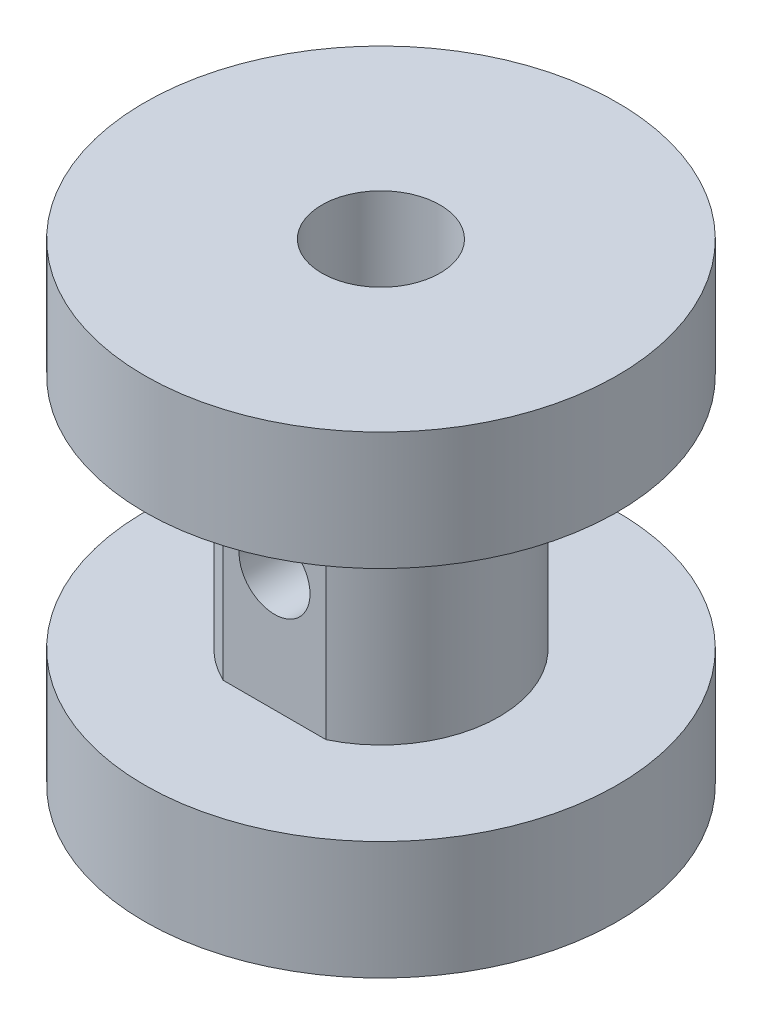
ISO-10303-21;
HEADER;
FILE_DESCRIPTION(('STEP AP214'),'2;1');
FILE_NAME('part.step','',(''),(''),'','','');
FILE_SCHEMA(('AUTOMOTIVE_DESIGN { 1 0 10303 214 1 1 1 1 }'));
ENDSEC;
DATA;
#1=APPLICATION_CONTEXT('core data for automotive mechanical design processes');
#2=APPLICATION_PROTOCOL_DEFINITION('international standard','automotive_design',2000,#1);
#3=PRODUCT_CONTEXT('',#1,'mechanical');
#4=PRODUCT('Part','Part','',(#3));
#5=PRODUCT_RELATED_PRODUCT_CATEGORY('part','',(#4));
#6=PRODUCT_DEFINITION_FORMATION('','',#4);
#7=PRODUCT_DEFINITION_CONTEXT('part definition',#1,'design');
#8=PRODUCT_DEFINITION('design','',#6,#7);
#9=PRODUCT_DEFINITION_SHAPE('','',#8);
#10=(LENGTH_UNIT() NAMED_UNIT(*) SI_UNIT(.MILLI.,.METRE.));
#11=(NAMED_UNIT(*) PLANE_ANGLE_UNIT() SI_UNIT($,.RADIAN.));
#12=(NAMED_UNIT(*) SI_UNIT($,.STERADIAN.) SOLID_ANGLE_UNIT());
#13=UNCERTAINTY_MEASURE_WITH_UNIT(LENGTH_MEASURE(1.E-05),#10,'distance_accuracy_value','');
#14=(GEOMETRIC_REPRESENTATION_CONTEXT(3) GLOBAL_UNCERTAINTY_ASSIGNED_CONTEXT((#13)) GLOBAL_UNIT_ASSIGNED_CONTEXT((#10,
#11,#12)) REPRESENTATION_CONTEXT('',''));
#15=CARTESIAN_POINT('',(0.,0.,0.));
#16=DIRECTION('',(0.,0.,1.));
#17=DIRECTION('',(1.,0.,0.));
#18=AXIS2_PLACEMENT_3D('',#15,#16,#17);
#19=CARTESIAN_POINT('',(0.,10.,0.));
#20=DIRECTION('',(0.,-1.,0.));
#21=DIRECTION('',(0.,0.,-1.));
#22=AXIS2_PLACEMENT_3D('',#19,#20,#21);
#23=CYLINDRICAL_SURFACE('',#22,10.);
#24=CARTESIAN_POINT('',(0.,-10.,0.));
#25=DIRECTION('',(0.,1.,0.));
#26=DIRECTION('',(0.,0.,1.));
#27=AXIS2_PLACEMENT_3D('',#24,#25,#26);
#28=CIRCLE('',#27,10.);
#29=CARTESIAN_POINT('',(0.,-10.,10.));
#30=VERTEX_POINT('',#29);
#31=EDGE_CURVE('E76',#30,#30,#28,.T.);
#32=ORIENTED_EDGE('',*,*,#31,.T.);
#33=EDGE_LOOP('',(#32));
#34=FACE_BOUND('',#33,.T.);
#35=CARTESIAN_POINT('',(0.,-5.,0.));
#36=DIRECTION('',(0.,1.,0.));
#37=DIRECTION('',(0.,0.,1.));
#38=AXIS2_PLACEMENT_3D('',#35,#36,#37);
#39=CIRCLE('',#38,10.);
#40=CARTESIAN_POINT('',(0.,-5.,10.));
#41=VERTEX_POINT('',#40);
#42=EDGE_CURVE('E86',#41,#41,#39,.T.);
#43=ORIENTED_EDGE('',*,*,#42,.F.);
#44=EDGE_LOOP('',(#43));
#45=FACE_BOUND('',#44,.T.);
#46=ADVANCED_FACE('F34',(#34,#45),#23,.T.);
#47=CARTESIAN_POINT('',(0.,5.,0.));
#48=DIRECTION('',(0.,1.,0.));
#49=DIRECTION('',(0.,0.,1.));
#50=AXIS2_PLACEMENT_3D('',#47,#48,#49);
#51=CIRCLE('',#50,10.);
#52=CARTESIAN_POINT('',(0.,5.,10.));
#53=VERTEX_POINT('',#52);
#54=EDGE_CURVE('E70',#53,#53,#51,.T.);
#55=ORIENTED_EDGE('',*,*,#54,.T.);
#56=EDGE_LOOP('',(#55));
#57=FACE_BOUND('',#56,.T.);
#58=CARTESIAN_POINT('',(0.,10.,0.));
#59=DIRECTION('',(0.,1.,0.));
#60=DIRECTION('',(0.,0.,1.));
#61=AXIS2_PLACEMENT_3D('',#58,#59,#60);
#62=CIRCLE('',#61,10.);
#63=CARTESIAN_POINT('',(0.,10.,10.));
#64=VERTEX_POINT('',#63);
#65=EDGE_CURVE('E44',#64,#64,#62,.T.);
#66=ORIENTED_EDGE('',*,*,#65,.F.);
#67=EDGE_LOOP('',(#66));
#68=FACE_BOUND('',#67,.T.);
#69=ADVANCED_FACE('F36',(#57,#68),#23,.T.);
#70=CARTESIAN_POINT('',(0.,10.,0.));
#71=DIRECTION('',(0.,-1.,0.));
#72=DIRECTION('',(0.,0.,-1.));
#73=AXIS2_PLACEMENT_3D('',#70,#71,#72);
#74=CYLINDRICAL_SURFACE('',#73,2.5);
#75=CARTESIAN_POINT('',(1.5,0.,2.));
#76=CARTESIAN_POINT('',(1.50000404108592,0.0754789752896368,1.99999416642511));
#77=CARTESIAN_POINT('',(1.49426852824013,0.150938434079796,2.00433633903481));
#78=CARTESIAN_POINT('',(1.47174965152787,0.299323903962216,2.02092590613883));
#79=CARTESIAN_POINT('',(1.45495475788936,0.372247187385098,2.03318155043097));
#80=CARTESIAN_POINT('',(1.41143486335795,0.513083641677277,2.0636233903473));
#81=CARTESIAN_POINT('',(1.3847815450315,0.581028838035267,2.0817666618312));
#82=CARTESIAN_POINT('',(1.32252909283019,0.711437453367919,2.12185904995836));
#83=CARTESIAN_POINT('',(1.28692729054693,0.773899229695138,2.14380930122416));
#84=CARTESIAN_POINT('',(1.20271292747644,0.899949016664082,2.19228594587542));
#85=CARTESIAN_POINT('',(1.15304179435289,0.962740957123942,2.21904371037662));
#86=CARTESIAN_POINT('',(1.04426801309985,1.07976476274175,2.27226229431061));
#87=CARTESIAN_POINT('',(0.985158296729613,1.1339901516708,2.29872287517103));
#88=CARTESIAN_POINT('',(0.851442367411702,1.2381338097097,2.35175567858734));
#89=CARTESIAN_POINT('',(0.775851995162548,1.28695446366975,2.37803133577818));
#90=CARTESIAN_POINT('',(0.615654228271659,1.37080972244443,2.42443786983179));
#91=CARTESIAN_POINT('',(0.531055196626331,1.40585697412271,2.44457437988735));
#92=CARTESIAN_POINT('',(0.363771406742667,1.45759592281265,2.4747098780044));
#93=CARTESIAN_POINT('',(0.281674698130916,1.4757203609673,2.4854930393917));
#94=CARTESIAN_POINT('',(0.114970509382709,1.49794280286312,2.49874939277545));
#95=CARTESIAN_POINT('',(0.0303654624001538,1.50205397800005,2.50123038813307));
#96=CARTESIAN_POINT('',(-0.127637283737309,1.49638625265754,2.49783372711539));
#97=CARTESIAN_POINT('',(-0.201123832865634,1.48826647383069,2.49295437513726));
#98=CARTESIAN_POINT('',(-0.345464269151768,1.46152020435189,2.47707997553857));
#99=CARTESIAN_POINT('',(-0.416317961051201,1.44289293609285,2.46608447529309));
#100=CARTESIAN_POINT('',(-0.55405678046908,1.39583443729622,2.43884907201719));
#101=CARTESIAN_POINT('',(-0.620916491037617,1.367346938861,2.42257910450824));
#102=CARTESIAN_POINT('',(-0.748988660115611,1.30161538377446,2.38609637638748));
#103=CARTESIAN_POINT('',(-0.810199646208011,1.26436905294099,2.36588259201812));
#104=CARTESIAN_POINT('',(-0.9330742671432,1.17716090719555,2.32037925976363));
#105=CARTESIAN_POINT('',(-0.993918663198193,1.12621168826426,2.2947718295215));
#106=CARTESIAN_POINT('',(-1.10671465909275,1.01559588213982,2.24255554245601));
#107=CARTESIAN_POINT('',(-1.1586540130834,0.955917496525494,2.21594536703375));
#108=CARTESIAN_POINT('',(-1.25824837767417,0.821346593836446,2.16111075123946));
#109=CARTESIAN_POINT('',(-1.30470933188632,0.745492423460539,2.13305661385124));
#110=CARTESIAN_POINT('',(-1.38397217194232,0.585293768363393,2.08250879557267));
#111=CARTESIAN_POINT('',(-1.41679921962189,0.500965283874358,2.0600049029882));
#112=CARTESIAN_POINT('',(-1.46077497064842,0.347606368104652,2.02895865196731));
#113=CARTESIAN_POINT('',(-1.47527903312665,0.279959367703356,2.01833888618316));
#114=CARTESIAN_POINT('',(-1.49480872755284,0.142626389700518,2.00392150777558));
#115=CARTESIAN_POINT('',(-1.49984538302907,0.0729428795154367,2.00011596115116));
#116=CARTESIAN_POINT('',(-1.50014781114183,-0.0665516824357071,1.99988914321323));
#117=CARTESIAN_POINT('',(-1.49540004697659,-0.13636277721521,2.00347810223984));
#118=CARTESIAN_POINT('',(-1.47640290574941,-0.273987343748558,2.01751520788652));
#119=CARTESIAN_POINT('',(-1.46214601830139,-0.341799192240254,2.02796877613213));
#120=CARTESIAN_POINT('',(-1.42488312618657,-0.473714579479786,2.054317683331));
#121=CARTESIAN_POINT('',(-1.40188805257362,-0.53782263653223,2.07020622092812));
#122=CARTESIAN_POINT('',(-1.34796261057072,-0.661477715730182,2.10571539417587));
#123=CARTESIAN_POINT('',(-1.31702924888212,-0.721023006366002,2.12533743689999));
#124=CARTESIAN_POINT('',(-1.24167439558512,-0.845240082512246,2.17036819177737));
#125=CARTESIAN_POINT('',(-1.19582663060303,-0.908900835096568,2.19618239397369));
#126=CARTESIAN_POINT('',(-1.09487395518701,-1.02828548484946,2.2482175480362));
#127=CARTESIAN_POINT('',(-1.03976018672402,-1.08400169216912,2.27443886711455));
#128=CARTESIAN_POINT('',(-0.913274837212767,-1.19322400735043,2.32835625910913));
#129=CARTESIAN_POINT('',(-0.840721108780192,-1.24550072660584,2.3558007587587));
#130=CARTESIAN_POINT('',(-0.686103100868021,-1.33690277683665,2.40537639133459));
#131=CARTESIAN_POINT('',(-0.604045176134703,-1.37603682784092,2.42751104449411));
#132=CARTESIAN_POINT('',(-0.438840232972139,-1.43686820343137,2.46252280092775));
#133=CARTESIAN_POINT('',(-0.356205963651259,-1.45962622779111,2.47595588067329));
#134=CARTESIAN_POINT('',(-0.187383063890858,-1.49071460284626,2.494407389061));
#135=CARTESIAN_POINT('',(-0.101198571781969,-1.49906129071762,2.49943534582737));
#136=CARTESIAN_POINT('',(0.0598120232009833,-1.50067460858593,2.50040600461976));
#137=CARTESIAN_POINT('',(0.134620583589705,-1.49580333456303,2.49747057186327));
#138=CARTESIAN_POINT('',(0.282148755978773,-1.47510617561839,2.48512948412095));
#139=CARTESIAN_POINT('',(0.354868344701913,-1.4592801686784,2.47572375706639));
#140=CARTESIAN_POINT('',(0.495145481978796,-1.41778042841622,2.45149427526962));
#141=CARTESIAN_POINT('',(0.562767032608829,-1.39226840387076,2.43675966858906));
#142=CARTESIAN_POINT('',(0.692781971999983,-1.33235940544525,2.40303337447155));
#143=CARTESIAN_POINT('',(0.755174184199832,-1.2979604391404,2.38404073252268));
#144=CARTESIAN_POINT('',(0.880263645295947,-1.21707480343124,2.34093432659381));
#145=CARTESIAN_POINT('',(0.942258690439939,-1.16968129098313,2.31648844639149));
#146=CARTESIAN_POINT('',(1.05789751536307,-1.06624696628228,2.26601907350661));
#147=CARTESIAN_POINT('',(1.11153190956916,-1.01019657439209,2.23999385274509));
#148=CARTESIAN_POINT('',(1.2159097535057,-0.882714437822302,2.18528165666204));
#149=CARTESIAN_POINT('',(1.26542406663367,-0.810233513834502,2.15667566270901));
#150=CARTESIAN_POINT('',(1.35156817210325,-0.65651514723346,2.10376464485145));
#151=CARTESIAN_POINT('',(1.38820466322661,-0.575282286018587,2.07945738811052));
#152=CARTESIAN_POINT('',(1.44437116535132,-0.412935714862799,2.0408000304796));
#153=CARTESIAN_POINT('',(1.46509526060187,-0.332404764038754,2.02577665830138));
#154=CARTESIAN_POINT('',(1.49289268240426,-0.167902605296321,2.00539032320036));
#155=CARTESIAN_POINT('',(1.49999550595837,-0.0839392342412885,2.00000648744643));
#156=CARTESIAN_POINT('',(1.5,0.,2.));
#157=B_SPLINE_CURVE_WITH_KNOTS('',3,(#75,#76,#77,#78,#79,#80,#81,#82,#83,#84,#85,#86,#87,#88,
#89,#90,#91,#92,#93,#94,#95,#96,#97,#98,#99,#100,#101,#102,#103,#104,#105,#106,#107,#108,#109,
#110,#111,#112,#113,#114,#115,#116,#117,#118,#119,#120,#121,#122,#123,#124,#125,#126,#127,#128,
#129,#130,#131,#132,#133,#134,#135,#136,#137,#138,#139,#140,#141,#142,#143,#144,#145,#146,#147,
#148,#149,#150,#151,#152,#153,#154,#155,#156),.UNSPECIFIED.,.T.,.F.,(4,2,2,2,2,2,2,2,2,2,2,2,2,
2,2,2,2,2,2,2,2,2,2,2,2,2,2,2,2,2,2,2,2,2,2,2,2,2,2,2,4),(0.,0.226085249493392,0.45240657433077,
0.677113624991876,0.901887762215932,1.15414462390001,1.40659128601844,1.68630157736223,
1.9657544327122,2.21853330858497,2.47107452602766,2.69230130543182,2.91354445887944,
3.13607155036377,3.35865648368878,3.60782810055849,3.85733966656908,4.13576671140276,
4.41367760154768,4.62276298054684,4.83160475643976,5.04073566011181,5.25003193304128,
5.45906724365495,5.66818149154661,5.91499438482002,6.16204457978454,6.44121828011588,
6.72020638384847,6.97891479383337,7.23732973022726,7.46129321849399,7.68525920139648,
7.90563970188756,8.12606965394584,8.37042963549487,8.61506198741955,8.89071695766604,
9.16622832484805,9.41820120134354,9.66962780912277),.UNSPECIFIED.);
#158=CARTESIAN_POINT('',(1.5,0.,2.));
#159=VERTEX_POINT('',#158);
#160=EDGE_CURVE('E83',#159,#159,#157,.T.);
#161=ORIENTED_EDGE('',*,*,#160,.T.);
#162=EDGE_LOOP('',(#161));
#163=FACE_BOUND('',#162,.T.);
#164=CARTESIAN_POINT('',(0.,10.,0.));
#165=DIRECTION('',(0.,1.,0.));
#166=DIRECTION('',(0.,0.,1.));
#167=AXIS2_PLACEMENT_3D('',#164,#165,#166);
#168=CIRCLE('',#167,2.5);
#169=CARTESIAN_POINT('',(0.,10.,2.5));
#170=VERTEX_POINT('',#169);
#171=EDGE_CURVE('E11',#170,#170,#168,.T.);
#172=ORIENTED_EDGE('',*,*,#171,.T.);
#173=EDGE_LOOP('',(#172));
#174=FACE_BOUND('',#173,.T.);
#175=CARTESIAN_POINT('',(0.,-10.,0.));
#176=DIRECTION('',(0.,1.,0.));
#177=DIRECTION('',(0.,0.,1.));
#178=AXIS2_PLACEMENT_3D('',#175,#176,#177);
#179=CIRCLE('',#178,2.5);
#180=CARTESIAN_POINT('',(0.,-10.,2.5));
#181=VERTEX_POINT('',#180);
#182=EDGE_CURVE('E38',#181,#181,#179,.T.);
#183=ORIENTED_EDGE('',*,*,#182,.F.);
#184=EDGE_LOOP('',(#183));
#185=FACE_BOUND('',#184,.T.);
#186=ADVANCED_FACE('F101',(#163,#174,#185),#74,.F.);
#187=CARTESIAN_POINT('',(0.,10.,0.));
#188=DIRECTION('',(0.,1.,0.));
#189=DIRECTION('',(0.,0.,1.));
#190=AXIS2_PLACEMENT_3D('',#187,#188,#189);
#191=PLANE('',#190);
#192=ORIENTED_EDGE('',*,*,#65,.T.);
#193=EDGE_LOOP('',(#192));
#194=FACE_BOUND('',#193,.T.);
#195=ORIENTED_EDGE('',*,*,#171,.F.);
#196=EDGE_LOOP('',(#195));
#197=FACE_BOUND('',#196,.T.);
#198=ADVANCED_FACE('F103',(#194,#197),#191,.T.);
#199=CARTESIAN_POINT('',(0.,-10.,0.));
#200=DIRECTION('',(0.,1.,0.));
#201=DIRECTION('',(0.,0.,1.));
#202=AXIS2_PLACEMENT_3D('',#199,#200,#201);
#203=PLANE('',#202);
#204=ORIENTED_EDGE('',*,*,#31,.F.);
#205=EDGE_LOOP('',(#204));
#206=FACE_BOUND('',#205,.T.);
#207=ORIENTED_EDGE('',*,*,#182,.T.);
#208=EDGE_LOOP('',(#207));
#209=FACE_BOUND('',#208,.T.);
#210=ADVANCED_FACE('F99',(#206,#209),#203,.F.);
#211=CARTESIAN_POINT('',(0.,-5.,0.));
#212=DIRECTION('',(0.,1.,0.));
#213=DIRECTION('',(0.,0.,1.));
#214=AXIS2_PLACEMENT_3D('',#211,#212,#213);
#215=CYLINDRICAL_SURFACE('',#214,5.);
#216=CARTESIAN_POINT('',(0.,5.,0.));
#217=DIRECTION('',(0.,1.,0.));
#218=DIRECTION('',(0.,0.,1.));
#219=AXIS2_PLACEMENT_3D('',#216,#217,#218);
#220=CIRCLE('',#219,5.);
#221=CARTESIAN_POINT('',(2.17944947177034,5.,4.5));
#222=VERTEX_POINT('',#221);
#223=CARTESIAN_POINT('',(-2.17944947177034,5.,4.5));
#224=VERTEX_POINT('',#223);
#225=EDGE_CURVE('E71',#222,#224,#220,.T.);
#226=ORIENTED_EDGE('',*,*,#225,.F.);
#227=DIRECTION('',(0.,1.,0.));
#228=VECTOR('',#227,1.);
#229=CARTESIAN_POINT('',(2.17944947177034,-5.,4.5));
#230=LINE('',#229,#228);
#231=CARTESIAN_POINT('',(2.17944947177034,-5.,4.5));
#232=VERTEX_POINT('',#231);
#233=EDGE_CURVE('E68',#232,#222,#230,.T.);
#234=ORIENTED_EDGE('',*,*,#233,.F.);
#235=CARTESIAN_POINT('',(0.,-5.,0.));
#236=DIRECTION('',(0.,1.,0.));
#237=DIRECTION('',(0.,0.,1.));
#238=AXIS2_PLACEMENT_3D('',#235,#236,#237);
#239=CIRCLE('',#238,5.);
#240=CARTESIAN_POINT('',(-2.17944947177034,-5.,4.5));
#241=VERTEX_POINT('',#240);
#242=EDGE_CURVE('E75',#232,#241,#239,.T.);
#243=ORIENTED_EDGE('',*,*,#242,.T.);
#244=DIRECTION('',(0.,1.,0.));
#245=VECTOR('',#244,1.);
#246=CARTESIAN_POINT('',(-2.17944947177034,-5.,4.5));
#247=LINE('',#246,#245);
#248=EDGE_CURVE('E66',#241,#224,#247,.T.);
#249=ORIENTED_EDGE('',*,*,#248,.T.);
#250=EDGE_LOOP('',(#226,#234,#243,#249));
#251=FACE_BOUND('',#250,.T.);
#252=ADVANCED_FACE('F74',(#251),#215,.T.);
#253=CARTESIAN_POINT('',(0.,-5.,4.5));
#254=DIRECTION('',(0.,0.,1.));
#255=DIRECTION('',(1.,0.,0.));
#256=AXIS2_PLACEMENT_3D('',#253,#254,#255);
#257=PLANE('',#256);
#258=CARTESIAN_POINT('',(0.,0.,4.5));
#259=DIRECTION('',(0.,0.,1.));
#260=DIRECTION('',(1.,0.,0.));
#261=AXIS2_PLACEMENT_3D('',#258,#259,#260);
#262=CIRCLE('',#261,1.5);
#263=CARTESIAN_POINT('',(1.5,0.,4.5));
#264=VERTEX_POINT('',#263);
#265=EDGE_CURVE('E80',#264,#264,#262,.T.);
#266=ORIENTED_EDGE('',*,*,#265,.F.);
#267=EDGE_LOOP('',(#266));
#268=FACE_BOUND('',#267,.T.);
#269=DIRECTION('',(1.,0.,0.));
#270=VECTOR('',#269,1.);
#271=CARTESIAN_POINT('',(0.,5.,4.5));
#272=LINE('',#271,#270);
#273=EDGE_CURVE('E60',#224,#222,#272,.T.);
#274=ORIENTED_EDGE('',*,*,#273,.F.);
#275=ORIENTED_EDGE('',*,*,#248,.F.);
#276=DIRECTION('',(1.,0.,0.));
#277=VECTOR('',#276,1.);
#278=CARTESIAN_POINT('',(0.,-5.,4.5));
#279=LINE('',#278,#277);
#280=EDGE_CURVE('E52',#241,#232,#279,.T.);
#281=ORIENTED_EDGE('',*,*,#280,.T.);
#282=ORIENTED_EDGE('',*,*,#233,.T.);
#283=EDGE_LOOP('',(#274,#275,#281,#282));
#284=FACE_BOUND('',#283,.T.);
#285=ADVANCED_FACE('F65',(#268,#284),#257,.T.);
#286=CARTESIAN_POINT('',(0.,-5.,0.));
#287=DIRECTION('',(0.,1.,0.));
#288=DIRECTION('',(0.,0.,1.));
#289=AXIS2_PLACEMENT_3D('',#286,#287,#288);
#290=PLANE('',#289);
#291=ORIENTED_EDGE('',*,*,#242,.F.);
#292=ORIENTED_EDGE('',*,*,#280,.F.);
#293=EDGE_LOOP('',(#291,#292));
#294=FACE_BOUND('',#293,.T.);
#295=ORIENTED_EDGE('',*,*,#42,.T.);
#296=EDGE_LOOP('',(#295));
#297=FACE_BOUND('',#296,.T.);
#298=ADVANCED_FACE('F132',(#294,#297),#290,.T.);
#299=CARTESIAN_POINT('',(0.,5.,0.));
#300=DIRECTION('',(0.,1.,0.));
#301=DIRECTION('',(0.,0.,1.));
#302=AXIS2_PLACEMENT_3D('',#299,#300,#301);
#303=PLANE('',#302);
#304=ORIENTED_EDGE('',*,*,#225,.T.);
#305=ORIENTED_EDGE('',*,*,#273,.T.);
#306=EDGE_LOOP('',(#304,#305));
#307=FACE_BOUND('',#306,.T.);
#308=ORIENTED_EDGE('',*,*,#54,.F.);
#309=EDGE_LOOP('',(#308));
#310=FACE_BOUND('',#309,.T.);
#311=ADVANCED_FACE('F78',(#307,#310),#303,.F.);
#312=CARTESIAN_POINT('',(0.,0.,-10.001));
#313=DIRECTION('',(0.,0.,1.));
#314=DIRECTION('',(1.,0.,0.));
#315=AXIS2_PLACEMENT_3D('',#312,#313,#314);
#316=CYLINDRICAL_SURFACE('',#315,1.5);
#317=ORIENTED_EDGE('',*,*,#160,.F.);
#318=EDGE_LOOP('',(#317));
#319=FACE_BOUND('',#318,.T.);
#320=ORIENTED_EDGE('',*,*,#265,.T.);
#321=EDGE_LOOP('',(#320));
#322=FACE_BOUND('',#321,.T.);
#323=ADVANCED_FACE('F128',(#319,#322),#316,.F.);
#324=CLOSED_SHELL('',(#46,#69,#186,#198,#210,#252,#285,#298,#311,#323));
#325=MANIFOLD_SOLID_BREP('B2',#324);
#326=ADVANCED_BREP_SHAPE_REPRESENTATION('',(#18,#325),#14);
#327=SHAPE_DEFINITION_REPRESENTATION(#9,#326);
ENDSEC;
END-ISO-10303-21;
